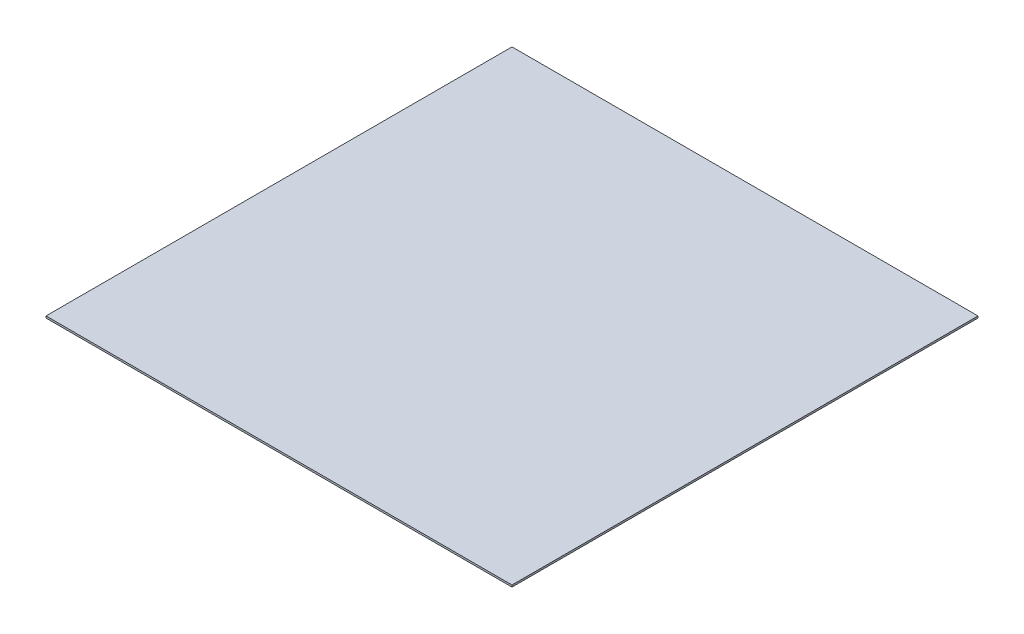
ISO-10303-21;
HEADER;
FILE_DESCRIPTION(('STEP AP214'),'2;1');
FILE_NAME('part.step','',(''),(''),'','','');
FILE_SCHEMA(('AUTOMOTIVE_DESIGN { 1 0 10303 214 1 1 1 1 }'));
ENDSEC;
DATA;
#1=APPLICATION_CONTEXT('core data for automotive mechanical design processes');
#2=APPLICATION_PROTOCOL_DEFINITION('international standard','automotive_design',2000,#1);
#3=PRODUCT_CONTEXT('',#1,'mechanical');
#4=PRODUCT('Part','Part','',(#3));
#5=PRODUCT_RELATED_PRODUCT_CATEGORY('part','',(#4));
#6=PRODUCT_DEFINITION_FORMATION('','',#4);
#7=PRODUCT_DEFINITION_CONTEXT('part definition',#1,'design');
#8=PRODUCT_DEFINITION('design','',#6,#7);
#9=PRODUCT_DEFINITION_SHAPE('','',#8);
#10=(LENGTH_UNIT() NAMED_UNIT(*) SI_UNIT(.MILLI.,.METRE.));
#11=(NAMED_UNIT(*) PLANE_ANGLE_UNIT() SI_UNIT($,.RADIAN.));
#12=(NAMED_UNIT(*) SI_UNIT($,.STERADIAN.) SOLID_ANGLE_UNIT());
#13=UNCERTAINTY_MEASURE_WITH_UNIT(LENGTH_MEASURE(1.E-05),#10,'distance_accuracy_value','');
#14=(GEOMETRIC_REPRESENTATION_CONTEXT(3) GLOBAL_UNCERTAINTY_ASSIGNED_CONTEXT((#13)) GLOBAL_UNIT_ASSIGNED_CONTEXT((#10,
#11,#12)) REPRESENTATION_CONTEXT('',''));
#15=CARTESIAN_POINT('',(0.,0.,0.));
#16=DIRECTION('',(0.,0.,1.));
#17=DIRECTION('',(1.,0.,0.));
#18=AXIS2_PLACEMENT_3D('',#15,#16,#17);
#19=CARTESIAN_POINT('',(2500.,20.,-2500.));
#20=DIRECTION('',(-1.,0.,0.));
#21=DIRECTION('',(0.,0.,1.));
#22=AXIS2_PLACEMENT_3D('',#19,#20,#21);
#23=PLANE('',#22);
#24=DIRECTION('',(0.,0.,-1.));
#25=VECTOR('',#24,1.);
#26=CARTESIAN_POINT('',(2500.,0.,-2500.));
#27=LINE('',#26,#25);
#28=CARTESIAN_POINT('',(2500.,0.,2500.));
#29=VERTEX_POINT('',#28);
#30=CARTESIAN_POINT('',(2500.,0.,-2500.));
#31=VERTEX_POINT('',#30);
#32=EDGE_CURVE('E100',#29,#31,#27,.T.);
#33=ORIENTED_EDGE('',*,*,#32,.T.);
#34=DIRECTION('',(0.,-1.,0.));
#35=VECTOR('',#34,1.);
#36=CARTESIAN_POINT('',(2500.,20.,-2500.));
#37=LINE('',#36,#35);
#38=CARTESIAN_POINT('',(2500.,20.,-2500.));
#39=VERTEX_POINT('',#38);
#40=EDGE_CURVE('E11',#39,#31,#37,.T.);
#41=ORIENTED_EDGE('',*,*,#40,.F.);
#42=DIRECTION('',(0.,0.,-1.));
#43=VECTOR('',#42,1.);
#44=CARTESIAN_POINT('',(2500.,20.,-2500.));
#45=LINE('',#44,#43);
#46=CARTESIAN_POINT('',(2500.,20.,2500.));
#47=VERTEX_POINT('',#46);
#48=EDGE_CURVE('E88',#47,#39,#45,.T.);
#49=ORIENTED_EDGE('',*,*,#48,.F.);
#50=DIRECTION('',(0.,-1.,0.));
#51=VECTOR('',#50,1.);
#52=CARTESIAN_POINT('',(2500.,20.,2500.));
#53=LINE('',#52,#51);
#54=EDGE_CURVE('E96',#47,#29,#53,.T.);
#55=ORIENTED_EDGE('',*,*,#54,.T.);
#56=EDGE_LOOP('',(#33,#41,#49,#55));
#57=FACE_BOUND('',#56,.T.);
#58=ADVANCED_FACE('F37',(#57),#23,.F.);
#59=CARTESIAN_POINT('',(-2500.,20.,-2500.));
#60=DIRECTION('',(0.,0.,1.));
#61=DIRECTION('',(1.,0.,0.));
#62=AXIS2_PLACEMENT_3D('',#59,#60,#61);
#63=PLANE('',#62);
#64=DIRECTION('',(-1.,0.,0.));
#65=VECTOR('',#64,1.);
#66=CARTESIAN_POINT('',(-2500.,0.,-2500.));
#67=LINE('',#66,#65);
#68=CARTESIAN_POINT('',(-2500.,0.,-2500.));
#69=VERTEX_POINT('',#68);
#70=EDGE_CURVE('E92',#31,#69,#67,.T.);
#71=ORIENTED_EDGE('',*,*,#70,.T.);
#72=DIRECTION('',(0.,-1.,0.));
#73=VECTOR('',#72,1.);
#74=CARTESIAN_POINT('',(-2500.,20.,-2500.));
#75=LINE('',#74,#73);
#76=CARTESIAN_POINT('',(-2500.,20.,-2500.));
#77=VERTEX_POINT('',#76);
#78=EDGE_CURVE('E45',#77,#69,#75,.T.);
#79=ORIENTED_EDGE('',*,*,#78,.F.);
#80=DIRECTION('',(-1.,0.,0.));
#81=VECTOR('',#80,1.);
#82=CARTESIAN_POINT('',(-2500.,20.,-2500.));
#83=LINE('',#82,#81);
#84=EDGE_CURVE('E83',#39,#77,#83,.T.);
#85=ORIENTED_EDGE('',*,*,#84,.F.);
#86=ORIENTED_EDGE('',*,*,#40,.T.);
#87=EDGE_LOOP('',(#71,#79,#85,#86));
#88=FACE_BOUND('',#87,.T.);
#89=ADVANCED_FACE('F91',(#88),#63,.F.);
#90=CARTESIAN_POINT('',(-2500.,20.,-2500.));
#91=DIRECTION('',(1.,0.,0.));
#92=DIRECTION('',(0.,0.,-1.));
#93=AXIS2_PLACEMENT_3D('',#90,#91,#92);
#94=PLANE('',#93);
#95=DIRECTION('',(0.,0.,1.));
#96=VECTOR('',#95,1.);
#97=CARTESIAN_POINT('',(-2500.,0.,-2500.));
#98=LINE('',#97,#96);
#99=CARTESIAN_POINT('',(-2500.,0.,2500.));
#100=VERTEX_POINT('',#99);
#101=EDGE_CURVE('E70',#69,#100,#98,.T.);
#102=ORIENTED_EDGE('',*,*,#101,.T.);
#103=DIRECTION('',(0.,-1.,0.));
#104=VECTOR('',#103,1.);
#105=CARTESIAN_POINT('',(-2500.,20.,2500.));
#106=LINE('',#105,#104);
#107=CARTESIAN_POINT('',(-2500.,20.,2500.));
#108=VERTEX_POINT('',#107);
#109=EDGE_CURVE('E93',#108,#100,#106,.T.);
#110=ORIENTED_EDGE('',*,*,#109,.F.);
#111=DIRECTION('',(0.,0.,1.));
#112=VECTOR('',#111,1.);
#113=CARTESIAN_POINT('',(-2500.,20.,-2500.));
#114=LINE('',#113,#112);
#115=EDGE_CURVE('E86',#77,#108,#114,.T.);
#116=ORIENTED_EDGE('',*,*,#115,.F.);
#117=ORIENTED_EDGE('',*,*,#78,.T.);
#118=EDGE_LOOP('',(#102,#110,#116,#117));
#119=FACE_BOUND('',#118,.T.);
#120=ADVANCED_FACE('F94',(#119),#94,.F.);
#121=CARTESIAN_POINT('',(-2500.,20.,2500.));
#122=DIRECTION('',(0.,0.,-1.));
#123=DIRECTION('',(-1.,0.,0.));
#124=AXIS2_PLACEMENT_3D('',#121,#122,#123);
#125=PLANE('',#124);
#126=DIRECTION('',(1.,0.,0.));
#127=VECTOR('',#126,1.);
#128=CARTESIAN_POINT('',(-2500.,0.,2500.));
#129=LINE('',#128,#127);
#130=EDGE_CURVE('E76',#100,#29,#129,.T.);
#131=ORIENTED_EDGE('',*,*,#130,.T.);
#132=ORIENTED_EDGE('',*,*,#54,.F.);
#133=DIRECTION('',(1.,0.,0.));
#134=VECTOR('',#133,1.);
#135=CARTESIAN_POINT('',(-2500.,20.,2500.));
#136=LINE('',#135,#134);
#137=EDGE_CURVE('E53',#108,#47,#136,.T.);
#138=ORIENTED_EDGE('',*,*,#137,.F.);
#139=ORIENTED_EDGE('',*,*,#109,.T.);
#140=EDGE_LOOP('',(#131,#132,#138,#139));
#141=FACE_BOUND('',#140,.T.);
#142=ADVANCED_FACE('F107',(#141),#125,.F.);
#143=CARTESIAN_POINT('',(0.,20.,0.));
#144=DIRECTION('',(0.,1.,0.));
#145=DIRECTION('',(0.,0.,1.));
#146=AXIS2_PLACEMENT_3D('',#143,#144,#145);
#147=PLANE('',#146);
#148=ORIENTED_EDGE('',*,*,#48,.T.);
#149=ORIENTED_EDGE('',*,*,#84,.T.);
#150=ORIENTED_EDGE('',*,*,#115,.T.);
#151=ORIENTED_EDGE('',*,*,#137,.T.);
#152=EDGE_LOOP('',(#148,#149,#150,#151));
#153=FACE_BOUND('',#152,.T.);
#154=ADVANCED_FACE('F84',(#153),#147,.T.);
#155=CARTESIAN_POINT('',(0.,0.,0.));
#156=DIRECTION('',(0.,1.,0.));
#157=DIRECTION('',(0.,0.,1.));
#158=AXIS2_PLACEMENT_3D('',#155,#156,#157);
#159=PLANE('',#158);
#160=ORIENTED_EDGE('',*,*,#32,.F.);
#161=ORIENTED_EDGE('',*,*,#130,.F.);
#162=ORIENTED_EDGE('',*,*,#101,.F.);
#163=ORIENTED_EDGE('',*,*,#70,.F.);
#164=EDGE_LOOP('',(#160,#161,#162,#163));
#165=FACE_BOUND('',#164,.T.);
#166=ADVANCED_FACE('F110',(#165),#159,.F.);
#167=CLOSED_SHELL('',(#58,#89,#120,#142,#154,#166));
#168=MANIFOLD_SOLID_BREP('B2',#167);
#169=ADVANCED_BREP_SHAPE_REPRESENTATION('',(#18,#168),#14);
#170=SHAPE_DEFINITION_REPRESENTATION(#9,#169);
ENDSEC;
END-ISO-10303-21;
